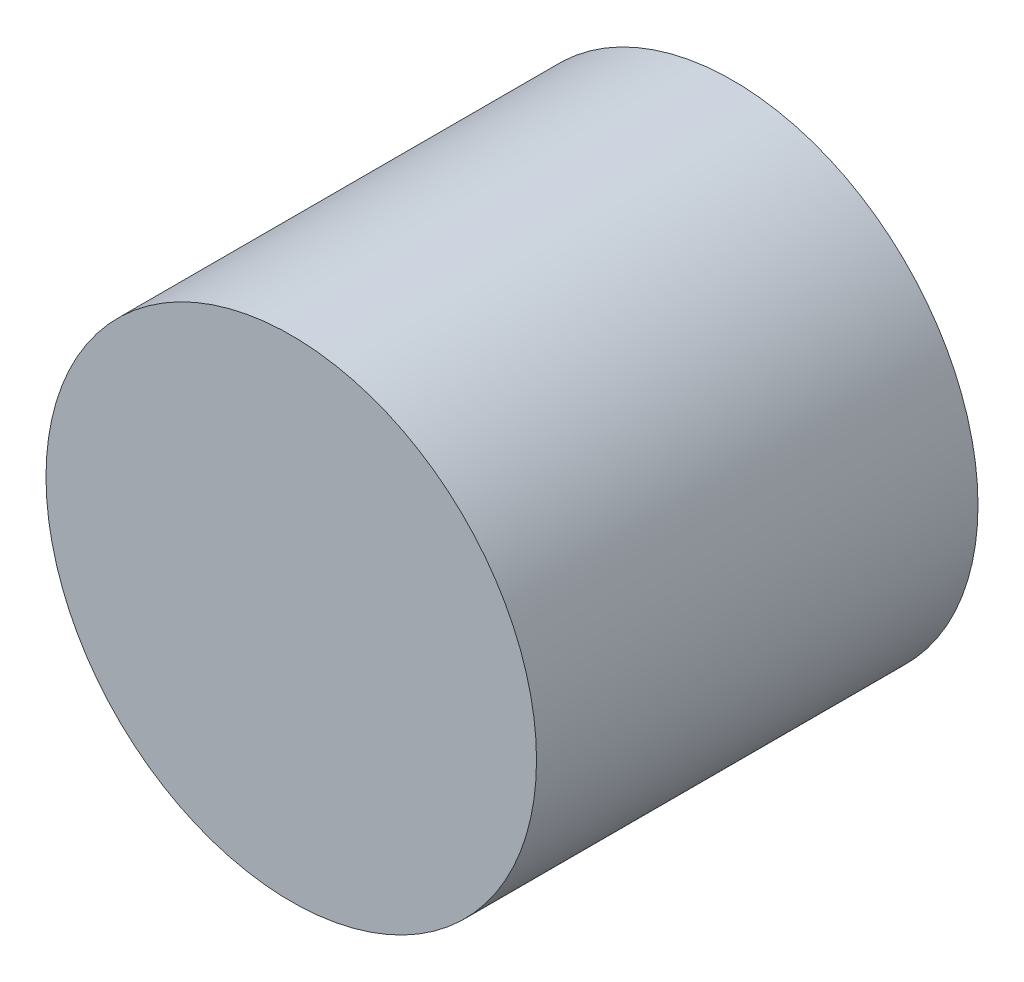
ISO-10303-21;
HEADER;
FILE_DESCRIPTION(('STEP AP214'),'2;1');
FILE_NAME('part.step','',(''),(''),'','','');
FILE_SCHEMA(('AUTOMOTIVE_DESIGN { 1 0 10303 214 1 1 1 1 }'));
ENDSEC;
DATA;
#1=APPLICATION_CONTEXT('core data for automotive mechanical design processes');
#2=APPLICATION_PROTOCOL_DEFINITION('international standard','automotive_design',2000,#1);
#3=PRODUCT_CONTEXT('',#1,'mechanical');
#4=PRODUCT('Part','Part','',(#3));
#5=PRODUCT_RELATED_PRODUCT_CATEGORY('part','',(#4));
#6=PRODUCT_DEFINITION_FORMATION('','',#4);
#7=PRODUCT_DEFINITION_CONTEXT('part definition',#1,'design');
#8=PRODUCT_DEFINITION('design','',#6,#7);
#9=PRODUCT_DEFINITION_SHAPE('','',#8);
#10=(LENGTH_UNIT() NAMED_UNIT(*) SI_UNIT(.MILLI.,.METRE.));
#11=(NAMED_UNIT(*) PLANE_ANGLE_UNIT() SI_UNIT($,.RADIAN.));
#12=(NAMED_UNIT(*) SI_UNIT($,.STERADIAN.) SOLID_ANGLE_UNIT());
#13=UNCERTAINTY_MEASURE_WITH_UNIT(LENGTH_MEASURE(1.E-05),#10,'distance_accuracy_value','');
#14=(GEOMETRIC_REPRESENTATION_CONTEXT(3) GLOBAL_UNCERTAINTY_ASSIGNED_CONTEXT((#13)) GLOBAL_UNIT_ASSIGNED_CONTEXT((#10,
#11,#12)) REPRESENTATION_CONTEXT('',''));
#15=CARTESIAN_POINT('',(0.,0.,0.));
#16=DIRECTION('',(0.,0.,1.));
#17=DIRECTION('',(1.,0.,0.));
#18=AXIS2_PLACEMENT_3D('',#15,#16,#17);
#19=CARTESIAN_POINT('',(0.,0.,1.8));
#20=DIRECTION('',(0.,0.,-1.));
#21=DIRECTION('',(-1.,0.,0.));
#22=AXIS2_PLACEMENT_3D('',#19,#20,#21);
#23=CYLINDRICAL_SURFACE('',#22,1.);
#24=CARTESIAN_POINT('',(0.,0.,1.8));
#25=DIRECTION('',(0.,0.,1.));
#26=DIRECTION('',(1.,0.,0.));
#27=AXIS2_PLACEMENT_3D('',#24,#25,#26);
#28=CIRCLE('',#27,1.);
#29=CARTESIAN_POINT('',(1.,0.,1.8));
#30=VERTEX_POINT('',#29);
#31=EDGE_CURVE('E10',#30,#30,#28,.T.);
#32=ORIENTED_EDGE('',*,*,#31,.F.);
#33=EDGE_LOOP('',(#32));
#34=FACE_BOUND('',#33,.T.);
#35=CARTESIAN_POINT('',(0.,0.,0.));
#36=DIRECTION('',(0.,0.,1.));
#37=DIRECTION('',(1.,0.,0.));
#38=AXIS2_PLACEMENT_3D('',#35,#36,#37);
#39=CIRCLE('',#38,1.);
#40=CARTESIAN_POINT('',(1.,0.,0.));
#41=VERTEX_POINT('',#40);
#42=EDGE_CURVE('E34',#41,#41,#39,.T.);
#43=ORIENTED_EDGE('',*,*,#42,.T.);
#44=EDGE_LOOP('',(#43));
#45=FACE_BOUND('',#44,.T.);
#46=ADVANCED_FACE('F31',(#34,#45),#23,.T.);
#47=CARTESIAN_POINT('',(0.,0.,1.8));
#48=DIRECTION('',(0.,0.,1.));
#49=DIRECTION('',(1.,0.,0.));
#50=AXIS2_PLACEMENT_3D('',#47,#48,#49);
#51=PLANE('',#50);
#52=ORIENTED_EDGE('',*,*,#31,.T.);
#53=EDGE_LOOP('',(#52));
#54=FACE_BOUND('',#53,.T.);
#55=ADVANCED_FACE('F46',(#54),#51,.T.);
#56=CARTESIAN_POINT('',(0.,0.,0.));
#57=DIRECTION('',(0.,0.,1.));
#58=DIRECTION('',(1.,0.,0.));
#59=AXIS2_PLACEMENT_3D('',#56,#57,#58);
#60=PLANE('',#59);
#61=ORIENTED_EDGE('',*,*,#42,.F.);
#62=EDGE_LOOP('',(#61));
#63=FACE_BOUND('',#62,.T.);
#64=ADVANCED_FACE('F44',(#63),#60,.F.);
#65=CLOSED_SHELL('',(#46,#55,#64));
#66=MANIFOLD_SOLID_BREP('B2',#65);
#67=ADVANCED_BREP_SHAPE_REPRESENTATION('',(#18,#66),#14);
#68=SHAPE_DEFINITION_REPRESENTATION(#9,#67);
ENDSEC;
END-ISO-10303-21;
